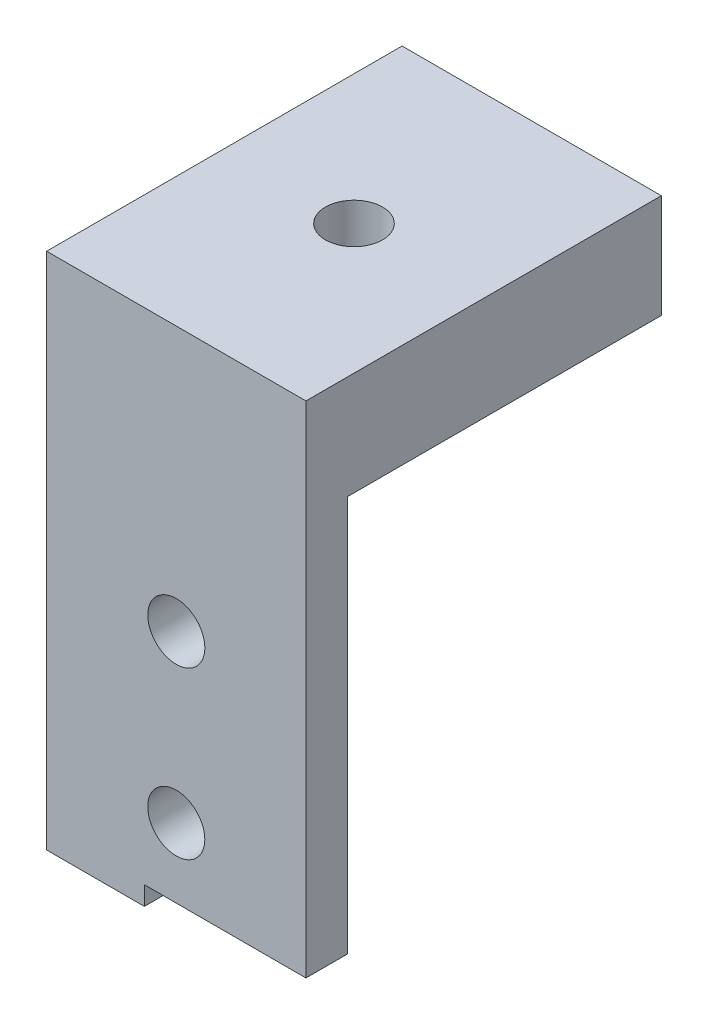
ISO-10303-21;
HEADER;
FILE_DESCRIPTION(('STEP AP214'),'2;1');
FILE_NAME('part.step','',(''),(''),'','','');
FILE_SCHEMA(('AUTOMOTIVE_DESIGN { 1 0 10303 214 1 1 1 1 }'));
ENDSEC;
DATA;
#1=APPLICATION_CONTEXT('core data for automotive mechanical design processes');
#2=APPLICATION_PROTOCOL_DEFINITION('international standard','automotive_design',2000,#1);
#3=PRODUCT_CONTEXT('',#1,'mechanical');
#4=PRODUCT('Part','Part','',(#3));
#5=PRODUCT_RELATED_PRODUCT_CATEGORY('part','',(#4));
#6=PRODUCT_DEFINITION_FORMATION('','',#4);
#7=PRODUCT_DEFINITION_CONTEXT('part definition',#1,'design');
#8=PRODUCT_DEFINITION('design','',#6,#7);
#9=PRODUCT_DEFINITION_SHAPE('','',#8);
#10=(LENGTH_UNIT() NAMED_UNIT(*) SI_UNIT(.MILLI.,.METRE.));
#11=(NAMED_UNIT(*) PLANE_ANGLE_UNIT() SI_UNIT($,.RADIAN.));
#12=(NAMED_UNIT(*) SI_UNIT($,.STERADIAN.) SOLID_ANGLE_UNIT());
#13=UNCERTAINTY_MEASURE_WITH_UNIT(LENGTH_MEASURE(1.E-05),#10,'distance_accuracy_value','');
#14=(GEOMETRIC_REPRESENTATION_CONTEXT(3) GLOBAL_UNCERTAINTY_ASSIGNED_CONTEXT((#13)) GLOBAL_UNIT_ASSIGNED_CONTEXT((#10,
#11,#12)) REPRESENTATION_CONTEXT('',''));
#15=CARTESIAN_POINT('',(0.,0.,0.));
#16=DIRECTION('',(0.,0.,1.));
#17=DIRECTION('',(1.,0.,0.));
#18=AXIS2_PLACEMENT_3D('',#15,#16,#17);
#19=CARTESIAN_POINT('',(6.25,-7.75,0.));
#20=DIRECTION('',(0.,0.,-1.));
#21=DIRECTION('',(-1.,0.,0.));
#22=AXIS2_PLACEMENT_3D('',#19,#20,#21);
#23=CYLINDRICAL_SURFACE('',#22,1.375);
#24=CARTESIAN_POINT('',(6.25,-7.75,0.));
#25=DIRECTION('',(0.,0.,-1.));
#26=DIRECTION('',(-1.,0.,0.));
#27=AXIS2_PLACEMENT_3D('',#24,#25,#26);
#28=CIRCLE('',#27,1.375);
#29=CARTESIAN_POINT('',(4.875,-7.75,0.));
#30=VERTEX_POINT('',#29);
#31=EDGE_CURVE('E172',#30,#30,#28,.T.);
#32=ORIENTED_EDGE('',*,*,#31,.F.);
#33=EDGE_LOOP('',(#32));
#34=FACE_BOUND('',#33,.T.);
#35=CARTESIAN_POINT('',(6.25,-7.75,-2.));
#36=DIRECTION('',(0.,0.,-1.));
#37=DIRECTION('',(-1.,0.,0.));
#38=AXIS2_PLACEMENT_3D('',#35,#36,#37);
#39=CIRCLE('',#38,1.375);
#40=CARTESIAN_POINT('',(4.875,-7.75,-2.));
#41=VERTEX_POINT('',#40);
#42=EDGE_CURVE('E158',#41,#41,#39,.F.);
#43=ORIENTED_EDGE('',*,*,#42,.F.);
#44=EDGE_LOOP('',(#43));
#45=FACE_BOUND('',#44,.T.);
#46=ADVANCED_FACE('F56',(#34,#45),#23,.F.);
#47=CARTESIAN_POINT('',(6.25,-15.75,0.));
#48=DIRECTION('',(0.,0.,-1.));
#49=DIRECTION('',(-1.,0.,0.));
#50=AXIS2_PLACEMENT_3D('',#47,#48,#49);
#51=CYLINDRICAL_SURFACE('',#50,1.375);
#52=CARTESIAN_POINT('',(6.25,-15.75,0.));
#53=DIRECTION('',(0.,0.,-1.));
#54=DIRECTION('',(1.,0.,0.));
#55=AXIS2_PLACEMENT_3D('',#52,#53,#54);
#56=CIRCLE('',#55,1.375);
#57=CARTESIAN_POINT('',(7.625,-15.75,0.));
#58=VERTEX_POINT('',#57);
#59=EDGE_CURVE('E167',#58,#58,#56,.T.);
#60=ORIENTED_EDGE('',*,*,#59,.F.);
#61=EDGE_LOOP('',(#60));
#62=FACE_BOUND('',#61,.T.);
#63=CARTESIAN_POINT('',(6.25,-15.75,-2.));
#64=DIRECTION('',(0.,0.,-1.));
#65=DIRECTION('',(-1.,0.,0.));
#66=AXIS2_PLACEMENT_3D('',#63,#64,#65);
#67=CIRCLE('',#66,1.375);
#68=CARTESIAN_POINT('',(4.875,-15.75,-2.));
#69=VERTEX_POINT('',#68);
#70=EDGE_CURVE('E166',#69,#69,#67,.F.);
#71=ORIENTED_EDGE('',*,*,#70,.F.);
#72=EDGE_LOOP('',(#71));
#73=FACE_BOUND('',#72,.T.);
#74=ADVANCED_FACE('F250',(#62,#73),#51,.F.);
#75=CARTESIAN_POINT('',(0.,0.,0.));
#76=DIRECTION('',(0.,-1.,0.));
#77=DIRECTION('',(0.,0.,-1.));
#78=AXIS2_PLACEMENT_3D('',#75,#76,#77);
#79=PLANE('',#78);
#80=CARTESIAN_POINT('',(6.25,0.,-8.5675));
#81=DIRECTION('',(0.,1.,0.));
#82=DIRECTION('',(0.,0.,1.));
#83=AXIS2_PLACEMENT_3D('',#80,#81,#82);
#84=CIRCLE('',#83,1.375);
#85=CARTESIAN_POINT('',(6.25,0.,-7.1925));
#86=VERTEX_POINT('',#85);
#87=EDGE_CURVE('E176',#86,#86,#84,.T.);
#88=ORIENTED_EDGE('',*,*,#87,.T.);
#89=EDGE_LOOP('',(#88));
#90=FACE_BOUND('',#89,.T.);
#91=DIRECTION('',(0.,0.,-1.));
#92=VECTOR('',#91,1.);
#93=CARTESIAN_POINT('',(12.5,0.,0.));
#94=LINE('',#93,#92);
#95=CARTESIAN_POINT('',(12.5,0.,-2.));
#96=VERTEX_POINT('',#95);
#97=CARTESIAN_POINT('',(12.5,0.,-17.135));
#98=VERTEX_POINT('',#97);
#99=EDGE_CURVE('E196',#96,#98,#94,.T.);
#100=ORIENTED_EDGE('',*,*,#99,.F.);
#101=DIRECTION('',(-1.,0.,0.));
#102=VECTOR('',#101,1.);
#103=CARTESIAN_POINT('',(0.,0.,-2.));
#104=LINE('',#103,#102);
#105=CARTESIAN_POINT('',(0.,0.,-2.));
#106=VERTEX_POINT('',#105);
#107=EDGE_CURVE('E152',#96,#106,#104,.T.);
#108=ORIENTED_EDGE('',*,*,#107,.T.);
#109=DIRECTION('',(0.,0.,1.));
#110=VECTOR('',#109,1.);
#111=CARTESIAN_POINT('',(0.,0.,0.));
#112=LINE('',#111,#110);
#113=CARTESIAN_POINT('',(0.,0.,-17.135));
#114=VERTEX_POINT('',#113);
#115=EDGE_CURVE('E149',#114,#106,#112,.T.);
#116=ORIENTED_EDGE('',*,*,#115,.F.);
#117=DIRECTION('',(-1.,0.,0.));
#118=VECTOR('',#117,1.);
#119=CARTESIAN_POINT('',(0.,0.,-17.135));
#120=LINE('',#119,#118);
#121=EDGE_CURVE('E95',#98,#114,#120,.T.);
#122=ORIENTED_EDGE('',*,*,#121,.F.);
#123=EDGE_LOOP('',(#100,#108,#116,#122));
#124=FACE_BOUND('',#123,.T.);
#125=ADVANCED_FACE('F217',(#90,#124),#79,.T.);
#126=CARTESIAN_POINT('',(0.,5.,0.));
#127=DIRECTION('',(1.,0.,0.));
#128=DIRECTION('',(0.,0.,-1.));
#129=AXIS2_PLACEMENT_3D('',#126,#127,#128);
#130=PLANE('',#129);
#131=DIRECTION('',(0.,-1.,0.));
#132=VECTOR('',#131,1.);
#133=CARTESIAN_POINT('',(0.,-21.,-2.));
#134=LINE('',#133,#132);
#135=CARTESIAN_POINT('',(0.,-20.,-2.));
#136=VERTEX_POINT('',#135);
#137=EDGE_CURVE('E143',#106,#136,#134,.T.);
#138=ORIENTED_EDGE('',*,*,#137,.T.);
#139=DIRECTION('',(0.,0.,-1.));
#140=VECTOR('',#139,1.);
#141=CARTESIAN_POINT('',(0.,-20.,8.));
#142=LINE('',#141,#140);
#143=CARTESIAN_POINT('',(0.,-20.,0.));
#144=VERTEX_POINT('',#143);
#145=EDGE_CURVE('E127',#144,#136,#142,.T.);
#146=ORIENTED_EDGE('',*,*,#145,.F.);
#147=DIRECTION('',(0.,-1.,0.));
#148=VECTOR('',#147,1.);
#149=CARTESIAN_POINT('',(0.,5.,0.));
#150=LINE('',#149,#148);
#151=CARTESIAN_POINT('',(0.,5.,0.));
#152=VERTEX_POINT('',#151);
#153=EDGE_CURVE('E65',#152,#144,#150,.T.);
#154=ORIENTED_EDGE('',*,*,#153,.F.);
#155=DIRECTION('',(0.,0.,1.));
#156=VECTOR('',#155,1.);
#157=CARTESIAN_POINT('',(0.,5.,0.));
#158=LINE('',#157,#156);
#159=CARTESIAN_POINT('',(0.,5.,-17.135));
#160=VERTEX_POINT('',#159);
#161=EDGE_CURVE('E100',#160,#152,#158,.T.);
#162=ORIENTED_EDGE('',*,*,#161,.F.);
#163=DIRECTION('',(0.,-1.,0.));
#164=VECTOR('',#163,1.);
#165=CARTESIAN_POINT('',(0.,5.,-17.135));
#166=LINE('',#165,#164);
#167=EDGE_CURVE('E193',#160,#114,#166,.T.);
#168=ORIENTED_EDGE('',*,*,#167,.T.);
#169=ORIENTED_EDGE('',*,*,#115,.T.);
#170=EDGE_LOOP('',(#138,#146,#154,#162,#168,#169));
#171=FACE_BOUND('',#170,.T.);
#172=ADVANCED_FACE('F58',(#171),#130,.F.);
#173=CARTESIAN_POINT('',(0.,5.,0.));
#174=DIRECTION('',(0.,0.,-1.));
#175=DIRECTION('',(-1.,0.,0.));
#176=AXIS2_PLACEMENT_3D('',#173,#174,#175);
#177=PLANE('',#176);
#178=ORIENTED_EDGE('',*,*,#59,.T.);
#179=EDGE_LOOP('',(#178));
#180=FACE_BOUND('',#179,.T.);
#181=ORIENTED_EDGE('',*,*,#31,.T.);
#182=EDGE_LOOP('',(#181));
#183=FACE_BOUND('',#182,.T.);
#184=ORIENTED_EDGE('',*,*,#153,.T.);
#185=DIRECTION('',(1.,0.,0.));
#186=VECTOR('',#185,1.);
#187=CARTESIAN_POINT('',(0.,-20.,0.));
#188=LINE('',#187,#186);
#189=CARTESIAN_POINT('',(4.71050671,-20.,0.));
#190=VERTEX_POINT('',#189);
#191=EDGE_CURVE('E130',#144,#190,#188,.T.);
#192=ORIENTED_EDGE('',*,*,#191,.T.);
#193=DIRECTION('',(0.,1.,0.));
#194=VECTOR('',#193,1.);
#195=CARTESIAN_POINT('',(4.71050671,5.,0.));
#196=LINE('',#195,#194);
#197=CARTESIAN_POINT('',(4.71050671,-19.09402601,0.));
#198=VERTEX_POINT('',#197);
#199=EDGE_CURVE('E230',#190,#198,#196,.T.);
#200=ORIENTED_EDGE('',*,*,#199,.T.);
#201=DIRECTION('',(1.,0.,0.));
#202=VECTOR('',#201,1.);
#203=CARTESIAN_POINT('',(0.,-19.09402601,0.));
#204=LINE('',#203,#202);
#205=CARTESIAN_POINT('',(12.5,-19.09402601,0.));
#206=VERTEX_POINT('',#205);
#207=EDGE_CURVE('E160',#198,#206,#204,.T.);
#208=ORIENTED_EDGE('',*,*,#207,.T.);
#209=DIRECTION('',(0.,-1.,0.));
#210=VECTOR('',#209,1.);
#211=CARTESIAN_POINT('',(12.5,5.,0.));
#212=LINE('',#211,#210);
#213=CARTESIAN_POINT('',(12.5,5.,0.));
#214=VERTEX_POINT('',#213);
#215=EDGE_CURVE('E206',#214,#206,#212,.T.);
#216=ORIENTED_EDGE('',*,*,#215,.F.);
#217=DIRECTION('',(1.,0.,0.));
#218=VECTOR('',#217,1.);
#219=CARTESIAN_POINT('',(0.,5.,0.));
#220=LINE('',#219,#218);
#221=EDGE_CURVE('E185',#152,#214,#220,.T.);
#222=ORIENTED_EDGE('',*,*,#221,.F.);
#223=EDGE_LOOP('',(#184,#192,#200,#208,#216,#222));
#224=FACE_BOUND('',#223,.T.);
#225=ADVANCED_FACE('F212',(#180,#183,#224),#177,.F.);
#226=CARTESIAN_POINT('',(12.5,5.,0.));
#227=DIRECTION('',(-1.,0.,0.));
#228=DIRECTION('',(0.,0.,1.));
#229=AXIS2_PLACEMENT_3D('',#226,#227,#228);
#230=PLANE('',#229);
#231=ORIENTED_EDGE('',*,*,#215,.T.);
#232=DIRECTION('',(0.,0.,-1.));
#233=VECTOR('',#232,1.);
#234=CARTESIAN_POINT('',(12.5,-19.09402601,8.));
#235=LINE('',#234,#233);
#236=CARTESIAN_POINT('',(12.5,-19.09402601,-2.));
#237=VERTEX_POINT('',#236);
#238=EDGE_CURVE('E224',#206,#237,#235,.T.);
#239=ORIENTED_EDGE('',*,*,#238,.T.);
#240=DIRECTION('',(0.,1.,0.));
#241=VECTOR('',#240,1.);
#242=CARTESIAN_POINT('',(12.5,0.,-2.));
#243=LINE('',#242,#241);
#244=EDGE_CURVE('E153',#237,#96,#243,.T.);
#245=ORIENTED_EDGE('',*,*,#244,.T.);
#246=ORIENTED_EDGE('',*,*,#99,.T.);
#247=DIRECTION('',(0.,-1.,0.));
#248=VECTOR('',#247,1.);
#249=CARTESIAN_POINT('',(12.5,5.,-17.135));
#250=LINE('',#249,#248);
#251=CARTESIAN_POINT('',(12.5,5.,-17.135));
#252=VERTEX_POINT('',#251);
#253=EDGE_CURVE('E203',#252,#98,#250,.T.);
#254=ORIENTED_EDGE('',*,*,#253,.F.);
#255=DIRECTION('',(0.,0.,-1.));
#256=VECTOR('',#255,1.);
#257=CARTESIAN_POINT('',(12.5,5.,0.));
#258=LINE('',#257,#256);
#259=EDGE_CURVE('E188',#214,#252,#258,.T.);
#260=ORIENTED_EDGE('',*,*,#259,.F.);
#261=EDGE_LOOP('',(#231,#239,#245,#246,#254,#260));
#262=FACE_BOUND('',#261,.T.);
#263=ADVANCED_FACE('F222',(#262),#230,.F.);
#264=CARTESIAN_POINT('',(0.,5.,-17.135));
#265=DIRECTION('',(0.,0.,1.));
#266=DIRECTION('',(1.,0.,0.));
#267=AXIS2_PLACEMENT_3D('',#264,#265,#266);
#268=PLANE('',#267);
#269=ORIENTED_EDGE('',*,*,#121,.T.);
#270=ORIENTED_EDGE('',*,*,#167,.F.);
#271=DIRECTION('',(-1.,0.,0.));
#272=VECTOR('',#271,1.);
#273=CARTESIAN_POINT('',(0.,5.,-17.135));
#274=LINE('',#273,#272);
#275=EDGE_CURVE('E80',#252,#160,#274,.T.);
#276=ORIENTED_EDGE('',*,*,#275,.F.);
#277=ORIENTED_EDGE('',*,*,#253,.T.);
#278=EDGE_LOOP('',(#269,#270,#276,#277));
#279=FACE_BOUND('',#278,.T.);
#280=ADVANCED_FACE('F272',(#279),#268,.F.);
#281=CARTESIAN_POINT('',(0.,5.,0.));
#282=DIRECTION('',(0.,-1.,0.));
#283=DIRECTION('',(0.,0.,-1.));
#284=AXIS2_PLACEMENT_3D('',#281,#282,#283);
#285=PLANE('',#284);
#286=ORIENTED_EDGE('',*,*,#259,.T.);
#287=ORIENTED_EDGE('',*,*,#275,.T.);
#288=ORIENTED_EDGE('',*,*,#161,.T.);
#289=ORIENTED_EDGE('',*,*,#221,.T.);
#290=EDGE_LOOP('',(#286,#287,#288,#289));
#291=FACE_BOUND('',#290,.T.);
#292=CARTESIAN_POINT('',(6.25,5.,-8.5675));
#293=DIRECTION('',(0.,1.,0.));
#294=DIRECTION('',(0.,0.,1.));
#295=AXIS2_PLACEMENT_3D('',#292,#293,#294);
#296=CIRCLE('',#295,1.375);
#297=CARTESIAN_POINT('',(6.25,5.,-7.1925));
#298=VERTEX_POINT('',#297);
#299=EDGE_CURVE('E171',#298,#298,#296,.T.);
#300=ORIENTED_EDGE('',*,*,#299,.F.);
#301=EDGE_LOOP('',(#300));
#302=FACE_BOUND('',#301,.T.);
#303=ADVANCED_FACE('F269',(#291,#302),#285,.F.);
#304=CARTESIAN_POINT('',(6.25,0.,-8.5675));
#305=DIRECTION('',(0.,1.,0.));
#306=DIRECTION('',(0.,0.,1.));
#307=AXIS2_PLACEMENT_3D('',#304,#305,#306);
#308=CYLINDRICAL_SURFACE('',#307,1.375);
#309=ORIENTED_EDGE('',*,*,#87,.F.);
#310=EDGE_LOOP('',(#309));
#311=FACE_BOUND('',#310,.T.);
#312=ORIENTED_EDGE('',*,*,#299,.T.);
#313=EDGE_LOOP('',(#312));
#314=FACE_BOUND('',#313,.T.);
#315=ADVANCED_FACE('F266',(#311,#314),#308,.F.);
#316=CARTESIAN_POINT('',(0.,5.,-2.));
#317=DIRECTION('',(0.,0.,-1.));
#318=DIRECTION('',(-1.,0.,0.));
#319=AXIS2_PLACEMENT_3D('',#316,#317,#318);
#320=PLANE('',#319);
#321=DIRECTION('',(1.,0.,0.));
#322=VECTOR('',#321,1.);
#323=CARTESIAN_POINT('',(0.,-20.,-2.));
#324=LINE('',#323,#322);
#325=CARTESIAN_POINT('',(4.71050671,-20.,-2.));
#326=VERTEX_POINT('',#325);
#327=EDGE_CURVE('E72',#136,#326,#324,.T.);
#328=ORIENTED_EDGE('',*,*,#327,.F.);
#329=ORIENTED_EDGE('',*,*,#137,.F.);
#330=ORIENTED_EDGE('',*,*,#107,.F.);
#331=ORIENTED_EDGE('',*,*,#244,.F.);
#332=DIRECTION('',(1.,0.,0.));
#333=VECTOR('',#332,1.);
#334=CARTESIAN_POINT('',(12.5,-19.09402601,-2.));
#335=LINE('',#334,#333);
#336=CARTESIAN_POINT('',(4.71050671,-19.09402601,-2.));
#337=VERTEX_POINT('',#336);
#338=EDGE_CURVE('E219',#337,#237,#335,.T.);
#339=ORIENTED_EDGE('',*,*,#338,.F.);
#340=DIRECTION('',(0.,1.,0.));
#341=VECTOR('',#340,1.);
#342=CARTESIAN_POINT('',(4.71050671,-21.,-2.));
#343=LINE('',#342,#341);
#344=EDGE_CURVE('E145',#326,#337,#343,.T.);
#345=ORIENTED_EDGE('',*,*,#344,.F.);
#346=EDGE_LOOP('',(#328,#329,#330,#331,#339,#345));
#347=FACE_BOUND('',#346,.T.);
#348=ORIENTED_EDGE('',*,*,#42,.T.);
#349=EDGE_LOOP('',(#348));
#350=FACE_BOUND('',#349,.T.);
#351=ORIENTED_EDGE('',*,*,#70,.T.);
#352=EDGE_LOOP('',(#351));
#353=FACE_BOUND('',#352,.T.);
#354=ADVANCED_FACE('F140',(#347,#350,#353),#320,.T.);
#355=CARTESIAN_POINT('',(12.5,-19.09402601,8.));
#356=DIRECTION('',(0.,1.,0.));
#357=DIRECTION('',(0.,0.,1.));
#358=AXIS2_PLACEMENT_3D('',#355,#356,#357);
#359=PLANE('',#358);
#360=DIRECTION('',(0.,0.,-1.));
#361=VECTOR('',#360,1.);
#362=CARTESIAN_POINT('',(4.71050671,-19.09402601,8.));
#363=LINE('',#362,#361);
#364=EDGE_CURVE('E231',#198,#337,#363,.T.);
#365=ORIENTED_EDGE('',*,*,#364,.T.);
#366=ORIENTED_EDGE('',*,*,#338,.T.);
#367=ORIENTED_EDGE('',*,*,#238,.F.);
#368=ORIENTED_EDGE('',*,*,#207,.F.);
#369=EDGE_LOOP('',(#365,#366,#367,#368));
#370=FACE_BOUND('',#369,.T.);
#371=ADVANCED_FACE('F287',(#370),#359,.F.);
#372=CARTESIAN_POINT('',(4.71050671,-21.,8.));
#373=DIRECTION('',(-1.,0.,0.));
#374=DIRECTION('',(0.,0.,1.));
#375=AXIS2_PLACEMENT_3D('',#372,#373,#374);
#376=PLANE('',#375);
#377=ORIENTED_EDGE('',*,*,#199,.F.);
#378=DIRECTION('',(0.,0.,-1.));
#379=VECTOR('',#378,1.);
#380=CARTESIAN_POINT('',(4.71050671,-20.,8.));
#381=LINE('',#380,#379);
#382=EDGE_CURVE('E14',#190,#326,#381,.T.);
#383=ORIENTED_EDGE('',*,*,#382,.T.);
#384=ORIENTED_EDGE('',*,*,#344,.T.);
#385=ORIENTED_EDGE('',*,*,#364,.F.);
#386=EDGE_LOOP('',(#377,#383,#384,#385));
#387=FACE_BOUND('',#386,.T.);
#388=ADVANCED_FACE('F291',(#387),#376,.F.);
#389=CARTESIAN_POINT('',(0.,-20.,8.));
#390=DIRECTION('',(0.,1.,0.));
#391=DIRECTION('',(0.,0.,1.));
#392=AXIS2_PLACEMENT_3D('',#389,#390,#391);
#393=PLANE('',#392);
#394=ORIENTED_EDGE('',*,*,#145,.T.);
#395=ORIENTED_EDGE('',*,*,#327,.T.);
#396=ORIENTED_EDGE('',*,*,#382,.F.);
#397=ORIENTED_EDGE('',*,*,#191,.F.);
#398=EDGE_LOOP('',(#394,#395,#396,#397));
#399=FACE_BOUND('',#398,.T.);
#400=ADVANCED_FACE('F128',(#399),#393,.F.);
#401=CLOSED_SHELL('',(#46,#74,#125,#172,#225,#263,#280,#303,#315,#354,#371,#388,#400));
#402=MANIFOLD_SOLID_BREP('B2',#401);
#403=ADVANCED_BREP_SHAPE_REPRESENTATION('',(#18,#402),#14);
#404=SHAPE_DEFINITION_REPRESENTATION(#9,#403);
ENDSEC;
END-ISO-10303-21;
